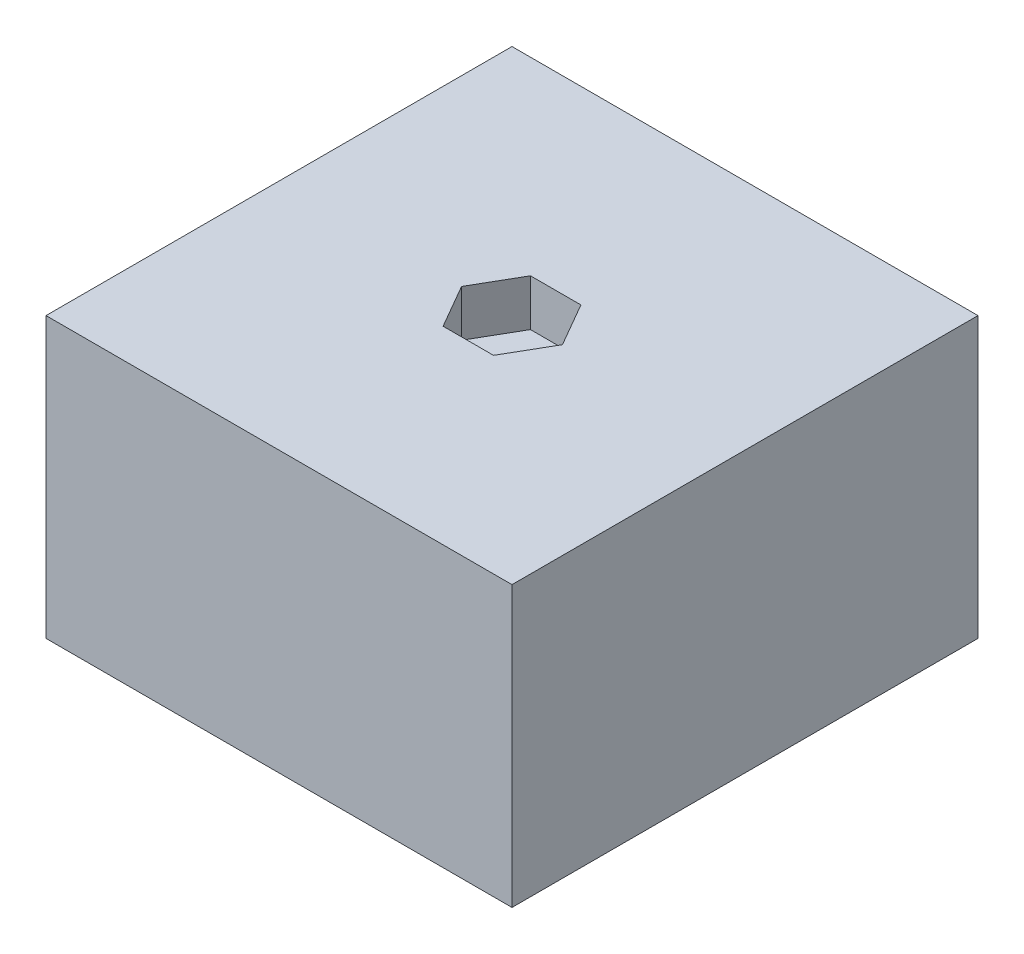
ISO-10303-21;
HEADER;
FILE_DESCRIPTION(('STEP AP214'),'2;1');
FILE_NAME('part.step','',(''),(''),'','','');
FILE_SCHEMA(('AUTOMOTIVE_DESIGN { 1 0 10303 214 1 1 1 1 }'));
ENDSEC;
DATA;
#1=APPLICATION_CONTEXT('core data for automotive mechanical design processes');
#2=APPLICATION_PROTOCOL_DEFINITION('international standard','automotive_design',2000,#1);
#3=PRODUCT_CONTEXT('',#1,'mechanical');
#4=PRODUCT('Part','Part','',(#3));
#5=PRODUCT_RELATED_PRODUCT_CATEGORY('part','',(#4));
#6=PRODUCT_DEFINITION_FORMATION('','',#4);
#7=PRODUCT_DEFINITION_CONTEXT('part definition',#1,'design');
#8=PRODUCT_DEFINITION('design','',#6,#7);
#9=PRODUCT_DEFINITION_SHAPE('','',#8);
#10=(LENGTH_UNIT() NAMED_UNIT(*) SI_UNIT(.MILLI.,.METRE.));
#11=(NAMED_UNIT(*) PLANE_ANGLE_UNIT() SI_UNIT($,.RADIAN.));
#12=(NAMED_UNIT(*) SI_UNIT($,.STERADIAN.) SOLID_ANGLE_UNIT());
#13=UNCERTAINTY_MEASURE_WITH_UNIT(LENGTH_MEASURE(1.E-05),#10,'distance_accuracy_value','');
#14=(GEOMETRIC_REPRESENTATION_CONTEXT(3) GLOBAL_UNCERTAINTY_ASSIGNED_CONTEXT((#13)) GLOBAL_UNIT_ASSIGNED_CONTEXT((#10,
#11,#12)) REPRESENTATION_CONTEXT('',''));
#15=CARTESIAN_POINT('',(0.,0.,0.));
#16=DIRECTION('',(0.,0.,1.));
#17=DIRECTION('',(1.,0.,0.));
#18=AXIS2_PLACEMENT_3D('',#15,#16,#17);
#19=CARTESIAN_POINT('',(6.35,7.62,-6.35));
#20=DIRECTION('',(-1.,0.,0.));
#21=DIRECTION('',(0.,0.,1.));
#22=AXIS2_PLACEMENT_3D('',#19,#20,#21);
#23=PLANE('',#22);
#24=DIRECTION('',(0.,0.,-1.));
#25=VECTOR('',#24,1.);
#26=CARTESIAN_POINT('',(6.35,0.,-6.35));
#27=LINE('',#26,#25);
#28=CARTESIAN_POINT('',(6.35,0.,6.35));
#29=VERTEX_POINT('',#28);
#30=CARTESIAN_POINT('',(6.35,0.,-6.35));
#31=VERTEX_POINT('',#30);
#32=EDGE_CURVE('E170',#29,#31,#27,.T.);
#33=ORIENTED_EDGE('',*,*,#32,.T.);
#34=DIRECTION('',(0.,-1.,0.));
#35=VECTOR('',#34,1.);
#36=CARTESIAN_POINT('',(6.35,7.62,-6.35));
#37=LINE('',#36,#35);
#38=CARTESIAN_POINT('',(6.35,7.62,-6.35));
#39=VERTEX_POINT('',#38);
#40=EDGE_CURVE('E11',#39,#31,#37,.T.);
#41=ORIENTED_EDGE('',*,*,#40,.F.);
#42=DIRECTION('',(0.,0.,-1.));
#43=VECTOR('',#42,1.);
#44=CARTESIAN_POINT('',(6.35,7.62,-6.35));
#45=LINE('',#44,#43);
#46=CARTESIAN_POINT('',(6.35,7.62,6.35));
#47=VERTEX_POINT('',#46);
#48=EDGE_CURVE('E178',#47,#39,#45,.T.);
#49=ORIENTED_EDGE('',*,*,#48,.F.);
#50=DIRECTION('',(0.,-1.,0.));
#51=VECTOR('',#50,1.);
#52=CARTESIAN_POINT('',(6.35,7.62,6.35));
#53=LINE('',#52,#51);
#54=EDGE_CURVE('E184',#47,#29,#53,.T.);
#55=ORIENTED_EDGE('',*,*,#54,.T.);
#56=EDGE_LOOP('',(#33,#41,#49,#55));
#57=FACE_BOUND('',#56,.T.);
#58=ADVANCED_FACE('F38',(#57),#23,.F.);
#59=CARTESIAN_POINT('',(-6.35,7.62,-6.35));
#60=DIRECTION('',(0.,0.,1.));
#61=DIRECTION('',(1.,0.,0.));
#62=AXIS2_PLACEMENT_3D('',#59,#60,#61);
#63=PLANE('',#62);
#64=DIRECTION('',(-1.,0.,0.));
#65=VECTOR('',#64,1.);
#66=CARTESIAN_POINT('',(-6.35,0.,-6.35));
#67=LINE('',#66,#65);
#68=CARTESIAN_POINT('',(-6.35,0.,-6.35));
#69=VERTEX_POINT('',#68);
#70=EDGE_CURVE('E187',#31,#69,#67,.T.);
#71=ORIENTED_EDGE('',*,*,#70,.T.);
#72=DIRECTION('',(0.,-1.,0.));
#73=VECTOR('',#72,1.);
#74=CARTESIAN_POINT('',(-6.35,7.62,-6.35));
#75=LINE('',#74,#73);
#76=CARTESIAN_POINT('',(-6.35,7.62,-6.35));
#77=VERTEX_POINT('',#76);
#78=EDGE_CURVE('E45',#77,#69,#75,.T.);
#79=ORIENTED_EDGE('',*,*,#78,.F.);
#80=DIRECTION('',(-1.,0.,0.));
#81=VECTOR('',#80,1.);
#82=CARTESIAN_POINT('',(-6.35,7.62,-6.35));
#83=LINE('',#82,#81);
#84=EDGE_CURVE('E89',#39,#77,#83,.T.);
#85=ORIENTED_EDGE('',*,*,#84,.F.);
#86=ORIENTED_EDGE('',*,*,#40,.T.);
#87=EDGE_LOOP('',(#71,#79,#85,#86));
#88=FACE_BOUND('',#87,.T.);
#89=ADVANCED_FACE('F216',(#88),#63,.F.);
#90=CARTESIAN_POINT('',(-6.35,7.62,-6.35));
#91=DIRECTION('',(1.,0.,0.));
#92=DIRECTION('',(0.,0.,-1.));
#93=AXIS2_PLACEMENT_3D('',#90,#91,#92);
#94=PLANE('',#93);
#95=DIRECTION('',(0.,0.,1.));
#96=VECTOR('',#95,1.);
#97=CARTESIAN_POINT('',(-6.35,0.,-6.35));
#98=LINE('',#97,#96);
#99=CARTESIAN_POINT('',(-6.35,0.,6.35));
#100=VERTEX_POINT('',#99);
#101=EDGE_CURVE('E189',#69,#100,#98,.T.);
#102=ORIENTED_EDGE('',*,*,#101,.T.);
#103=DIRECTION('',(0.,-1.,0.));
#104=VECTOR('',#103,1.);
#105=CARTESIAN_POINT('',(-6.35,7.62,6.35));
#106=LINE('',#105,#104);
#107=CARTESIAN_POINT('',(-6.35,7.62,6.35));
#108=VERTEX_POINT('',#107);
#109=EDGE_CURVE('E193',#108,#100,#106,.T.);
#110=ORIENTED_EDGE('',*,*,#109,.F.);
#111=DIRECTION('',(0.,0.,1.));
#112=VECTOR('',#111,1.);
#113=CARTESIAN_POINT('',(-6.35,7.62,-6.35));
#114=LINE('',#113,#112);
#115=EDGE_CURVE('E181',#77,#108,#114,.T.);
#116=ORIENTED_EDGE('',*,*,#115,.F.);
#117=ORIENTED_EDGE('',*,*,#78,.T.);
#118=EDGE_LOOP('',(#102,#110,#116,#117));
#119=FACE_BOUND('',#118,.T.);
#120=ADVANCED_FACE('F198',(#119),#94,.F.);
#121=CARTESIAN_POINT('',(-6.35,7.62,6.35));
#122=DIRECTION('',(0.,0.,-1.));
#123=DIRECTION('',(-1.,0.,0.));
#124=AXIS2_PLACEMENT_3D('',#121,#122,#123);
#125=PLANE('',#124);
#126=DIRECTION('',(1.,0.,0.));
#127=VECTOR('',#126,1.);
#128=CARTESIAN_POINT('',(-6.35,0.,6.35));
#129=LINE('',#128,#127);
#130=EDGE_CURVE('E82',#100,#29,#129,.T.);
#131=ORIENTED_EDGE('',*,*,#130,.T.);
#132=ORIENTED_EDGE('',*,*,#54,.F.);
#133=DIRECTION('',(1.,0.,0.));
#134=VECTOR('',#133,1.);
#135=CARTESIAN_POINT('',(-6.35,7.62,6.35));
#136=LINE('',#135,#134);
#137=EDGE_CURVE('E61',#108,#47,#136,.T.);
#138=ORIENTED_EDGE('',*,*,#137,.F.);
#139=ORIENTED_EDGE('',*,*,#109,.T.);
#140=EDGE_LOOP('',(#131,#132,#138,#139));
#141=FACE_BOUND('',#140,.T.);
#142=ADVANCED_FACE('F206',(#141),#125,.F.);
#143=CARTESIAN_POINT('',(0.,7.62,0.));
#144=DIRECTION('',(0.,1.,0.));
#145=DIRECTION('',(0.,0.,1.));
#146=AXIS2_PLACEMENT_3D('',#143,#144,#145);
#147=PLANE('',#146);
#148=DIRECTION('',(1.,0.,0.));
#149=VECTOR('',#148,1.);
#150=CARTESIAN_POINT('',(-0.687407664253899,7.62,1.190625));
#151=LINE('',#150,#149);
#152=CARTESIAN_POINT('',(-0.687407664253899,7.62,1.190625));
#153=VERTEX_POINT('',#152);
#154=CARTESIAN_POINT('',(0.687407664253898,7.62,1.190625));
#155=VERTEX_POINT('',#154);
#156=EDGE_CURVE('E52',#153,#155,#151,.T.);
#157=ORIENTED_EDGE('',*,*,#156,.F.);
#158=DIRECTION('',(0.5,0.,0.866025403784439));
#159=VECTOR('',#158,1.);
#160=CARTESIAN_POINT('',(-1.3748153285078,7.62,0.));
#161=LINE('',#160,#159);
#162=CARTESIAN_POINT('',(-1.3748153285078,7.62,0.));
#163=VERTEX_POINT('',#162);
#164=EDGE_CURVE('E144',#163,#153,#161,.T.);
#165=ORIENTED_EDGE('',*,*,#164,.F.);
#166=DIRECTION('',(-0.5,0.,0.866025403784439));
#167=VECTOR('',#166,1.);
#168=CARTESIAN_POINT('',(-0.687407664253899,7.62,-1.190625));
#169=LINE('',#168,#167);
#170=CARTESIAN_POINT('',(-0.687407664253899,7.62,-1.190625));
#171=VERTEX_POINT('',#170);
#172=EDGE_CURVE('E147',#171,#163,#169,.T.);
#173=ORIENTED_EDGE('',*,*,#172,.F.);
#174=DIRECTION('',(-1.,0.,0.));
#175=VECTOR('',#174,1.);
#176=CARTESIAN_POINT('',(0.687407664253897,7.62,-1.190625));
#177=LINE('',#176,#175);
#178=CARTESIAN_POINT('',(0.687407664253897,7.62,-1.190625));
#179=VERTEX_POINT('',#178);
#180=EDGE_CURVE('E163',#179,#171,#177,.T.);
#181=ORIENTED_EDGE('',*,*,#180,.F.);
#182=DIRECTION('',(-0.5,0.,-0.866025403784439));
#183=VECTOR('',#182,1.);
#184=CARTESIAN_POINT('',(1.3748153285078,7.62,0.));
#185=LINE('',#184,#183);
#186=CARTESIAN_POINT('',(1.3748153285078,7.62,0.));
#187=VERTEX_POINT('',#186);
#188=EDGE_CURVE('E160',#187,#179,#185,.T.);
#189=ORIENTED_EDGE('',*,*,#188,.F.);
#190=DIRECTION('',(0.5,0.,-0.866025403784439));
#191=VECTOR('',#190,1.);
#192=CARTESIAN_POINT('',(0.687407664253898,7.62,1.190625));
#193=LINE('',#192,#191);
#194=EDGE_CURVE('E158',#155,#187,#193,.T.);
#195=ORIENTED_EDGE('',*,*,#194,.F.);
#196=EDGE_LOOP('',(#157,#165,#173,#181,#189,#195));
#197=FACE_BOUND('',#196,.T.);
#198=ORIENTED_EDGE('',*,*,#48,.T.);
#199=ORIENTED_EDGE('',*,*,#84,.T.);
#200=ORIENTED_EDGE('',*,*,#115,.T.);
#201=ORIENTED_EDGE('',*,*,#137,.T.);
#202=EDGE_LOOP('',(#198,#199,#200,#201));
#203=FACE_BOUND('',#202,.T.);
#204=ADVANCED_FACE('F208',(#197,#203),#147,.T.);
#205=CARTESIAN_POINT('',(0.,0.,0.));
#206=DIRECTION('',(0.,1.,0.));
#207=DIRECTION('',(0.,0.,1.));
#208=AXIS2_PLACEMENT_3D('',#205,#206,#207);
#209=PLANE('',#208);
#210=ORIENTED_EDGE('',*,*,#32,.F.);
#211=ORIENTED_EDGE('',*,*,#130,.F.);
#212=ORIENTED_EDGE('',*,*,#101,.F.);
#213=ORIENTED_EDGE('',*,*,#70,.F.);
#214=EDGE_LOOP('',(#210,#211,#212,#213));
#215=FACE_BOUND('',#214,.T.);
#216=ADVANCED_FACE('F202',(#215),#209,.F.);
#217=CARTESIAN_POINT('',(-0.687407664253899,6.35,1.190625));
#218=DIRECTION('',(0.,0.,1.));
#219=DIRECTION('',(1.,0.,0.));
#220=AXIS2_PLACEMENT_3D('',#217,#218,#219);
#221=PLANE('',#220);
#222=ORIENTED_EDGE('',*,*,#156,.T.);
#223=DIRECTION('',(0.,1.,0.));
#224=VECTOR('',#223,1.);
#225=CARTESIAN_POINT('',(0.687407664253898,6.35,1.190625));
#226=LINE('',#225,#224);
#227=CARTESIAN_POINT('',(0.687407664253898,6.35,1.190625));
#228=VERTEX_POINT('',#227);
#229=EDGE_CURVE('E121',#228,#155,#226,.T.);
#230=ORIENTED_EDGE('',*,*,#229,.F.);
#231=DIRECTION('',(1.,0.,0.));
#232=VECTOR('',#231,1.);
#233=CARTESIAN_POINT('',(-0.687407664253899,6.35,1.190625));
#234=LINE('',#233,#232);
#235=CARTESIAN_POINT('',(-0.687407664253899,6.35,1.190625));
#236=VERTEX_POINT('',#235);
#237=EDGE_CURVE('E125',#236,#228,#234,.T.);
#238=ORIENTED_EDGE('',*,*,#237,.F.);
#239=DIRECTION('',(0.,1.,0.));
#240=VECTOR('',#239,1.);
#241=CARTESIAN_POINT('',(-0.687407664253899,6.35,1.190625));
#242=LINE('',#241,#240);
#243=EDGE_CURVE('E168',#236,#153,#242,.T.);
#244=ORIENTED_EDGE('',*,*,#243,.T.);
#245=EDGE_LOOP('',(#222,#230,#238,#244));
#246=FACE_BOUND('',#245,.T.);
#247=ADVANCED_FACE('F123',(#246),#221,.F.);
#248=CARTESIAN_POINT('',(-1.3748153285078,6.35,0.));
#249=DIRECTION('',(-0.866025403784439,0.,0.5));
#250=DIRECTION('',(0.5,0.,0.866025403784439));
#251=AXIS2_PLACEMENT_3D('',#248,#249,#250);
#252=PLANE('',#251);
#253=ORIENTED_EDGE('',*,*,#164,.T.);
#254=ORIENTED_EDGE('',*,*,#243,.F.);
#255=DIRECTION('',(0.5,0.,0.866025403784439));
#256=VECTOR('',#255,1.);
#257=CARTESIAN_POINT('',(-1.3748153285078,6.35,0.));
#258=LINE('',#257,#256);
#259=CARTESIAN_POINT('',(-1.3748153285078,6.35,0.));
#260=VERTEX_POINT('',#259);
#261=EDGE_CURVE('E131',#260,#236,#258,.T.);
#262=ORIENTED_EDGE('',*,*,#261,.F.);
#263=DIRECTION('',(0.,1.,0.));
#264=VECTOR('',#263,1.);
#265=CARTESIAN_POINT('',(-1.3748153285078,6.35,0.));
#266=LINE('',#265,#264);
#267=EDGE_CURVE('E171',#260,#163,#266,.T.);
#268=ORIENTED_EDGE('',*,*,#267,.T.);
#269=EDGE_LOOP('',(#253,#254,#262,#268));
#270=FACE_BOUND('',#269,.T.);
#271=ADVANCED_FACE('F255',(#270),#252,.F.);
#272=CARTESIAN_POINT('',(-0.687407664253899,6.35,-1.190625));
#273=DIRECTION('',(-0.866025403784439,0.,-0.5));
#274=DIRECTION('',(-0.5,0.,0.866025403784439));
#275=AXIS2_PLACEMENT_3D('',#272,#273,#274);
#276=PLANE('',#275);
#277=ORIENTED_EDGE('',*,*,#172,.T.);
#278=ORIENTED_EDGE('',*,*,#267,.F.);
#279=DIRECTION('',(-0.5,0.,0.866025403784439));
#280=VECTOR('',#279,1.);
#281=CARTESIAN_POINT('',(-0.687407664253899,6.35,-1.190625));
#282=LINE('',#281,#280);
#283=CARTESIAN_POINT('',(-0.687407664253899,6.35,-1.190625));
#284=VERTEX_POINT('',#283);
#285=EDGE_CURVE('E154',#284,#260,#282,.T.);
#286=ORIENTED_EDGE('',*,*,#285,.F.);
#287=DIRECTION('',(0.,1.,0.));
#288=VECTOR('',#287,1.);
#289=CARTESIAN_POINT('',(-0.687407664253899,6.35,-1.190625));
#290=LINE('',#289,#288);
#291=EDGE_CURVE('E173',#284,#171,#290,.T.);
#292=ORIENTED_EDGE('',*,*,#291,.T.);
#293=EDGE_LOOP('',(#277,#278,#286,#292));
#294=FACE_BOUND('',#293,.T.);
#295=ADVANCED_FACE('F264',(#294),#276,.F.);
#296=CARTESIAN_POINT('',(0.687407664253897,6.35,-1.190625));
#297=DIRECTION('',(0.,0.,-1.));
#298=DIRECTION('',(-1.,0.,0.));
#299=AXIS2_PLACEMENT_3D('',#296,#297,#298);
#300=PLANE('',#299);
#301=ORIENTED_EDGE('',*,*,#180,.T.);
#302=ORIENTED_EDGE('',*,*,#291,.F.);
#303=DIRECTION('',(-1.,0.,0.));
#304=VECTOR('',#303,1.);
#305=CARTESIAN_POINT('',(0.687407664253897,6.35,-1.190625));
#306=LINE('',#305,#304);
#307=CARTESIAN_POINT('',(0.687407664253897,6.35,-1.190625));
#308=VERTEX_POINT('',#307);
#309=EDGE_CURVE('E151',#308,#284,#306,.T.);
#310=ORIENTED_EDGE('',*,*,#309,.F.);
#311=DIRECTION('',(0.,1.,0.));
#312=VECTOR('',#311,1.);
#313=CARTESIAN_POINT('',(0.687407664253897,6.35,-1.190625));
#314=LINE('',#313,#312);
#315=EDGE_CURVE('E175',#308,#179,#314,.T.);
#316=ORIENTED_EDGE('',*,*,#315,.T.);
#317=EDGE_LOOP('',(#301,#302,#310,#316));
#318=FACE_BOUND('',#317,.T.);
#319=ADVANCED_FACE('F274',(#318),#300,.F.);
#320=CARTESIAN_POINT('',(1.3748153285078,6.35,0.));
#321=DIRECTION('',(0.866025403784439,0.,-0.5));
#322=DIRECTION('',(-0.5,0.,-0.866025403784439));
#323=AXIS2_PLACEMENT_3D('',#320,#321,#322);
#324=PLANE('',#323);
#325=ORIENTED_EDGE('',*,*,#188,.T.);
#326=ORIENTED_EDGE('',*,*,#315,.F.);
#327=DIRECTION('',(-0.5,0.,-0.866025403784439));
#328=VECTOR('',#327,1.);
#329=CARTESIAN_POINT('',(1.3748153285078,6.35,0.));
#330=LINE('',#329,#328);
#331=CARTESIAN_POINT('',(1.3748153285078,6.35,0.));
#332=VERTEX_POINT('',#331);
#333=EDGE_CURVE('E139',#332,#308,#330,.T.);
#334=ORIENTED_EDGE('',*,*,#333,.F.);
#335=DIRECTION('',(0.,1.,0.));
#336=VECTOR('',#335,1.);
#337=CARTESIAN_POINT('',(1.3748153285078,6.35,0.));
#338=LINE('',#337,#336);
#339=EDGE_CURVE('E130',#332,#187,#338,.T.);
#340=ORIENTED_EDGE('',*,*,#339,.T.);
#341=EDGE_LOOP('',(#325,#326,#334,#340));
#342=FACE_BOUND('',#341,.T.);
#343=ADVANCED_FACE('F284',(#342),#324,.F.);
#344=CARTESIAN_POINT('',(0.687407664253898,6.35,1.190625));
#345=DIRECTION('',(0.866025403784439,0.,0.5));
#346=DIRECTION('',(0.5,0.,-0.866025403784439));
#347=AXIS2_PLACEMENT_3D('',#344,#345,#346);
#348=PLANE('',#347);
#349=ORIENTED_EDGE('',*,*,#194,.T.);
#350=ORIENTED_EDGE('',*,*,#339,.F.);
#351=DIRECTION('',(0.5,0.,-0.866025403784439));
#352=VECTOR('',#351,1.);
#353=CARTESIAN_POINT('',(0.687407664253898,6.35,1.190625));
#354=LINE('',#353,#352);
#355=EDGE_CURVE('E134',#228,#332,#354,.T.);
#356=ORIENTED_EDGE('',*,*,#355,.F.);
#357=ORIENTED_EDGE('',*,*,#229,.T.);
#358=EDGE_LOOP('',(#349,#350,#356,#357));
#359=FACE_BOUND('',#358,.T.);
#360=ADVANCED_FACE('F135',(#359),#348,.F.);
#361=CARTESIAN_POINT('',(0.,6.35,0.));
#362=DIRECTION('',(0.,1.,0.));
#363=DIRECTION('',(0.,0.,1.));
#364=AXIS2_PLACEMENT_3D('',#361,#362,#363);
#365=PLANE('',#364);
#366=ORIENTED_EDGE('',*,*,#237,.T.);
#367=ORIENTED_EDGE('',*,*,#355,.T.);
#368=ORIENTED_EDGE('',*,*,#333,.T.);
#369=ORIENTED_EDGE('',*,*,#309,.T.);
#370=ORIENTED_EDGE('',*,*,#285,.T.);
#371=ORIENTED_EDGE('',*,*,#261,.T.);
#372=EDGE_LOOP('',(#366,#367,#368,#369,#370,#371));
#373=FACE_BOUND('',#372,.T.);
#374=ADVANCED_FACE('F141',(#373),#365,.T.);
#375=CLOSED_SHELL('',(#58,#89,#120,#142,#204,#216,#247,#271,#295,#319,#343,#360,#374));
#376=MANIFOLD_SOLID_BREP('B2',#375);
#377=ADVANCED_BREP_SHAPE_REPRESENTATION('',(#18,#376),#14);
#378=SHAPE_DEFINITION_REPRESENTATION(#9,#377);
ENDSEC;
END-ISO-10303-21;
